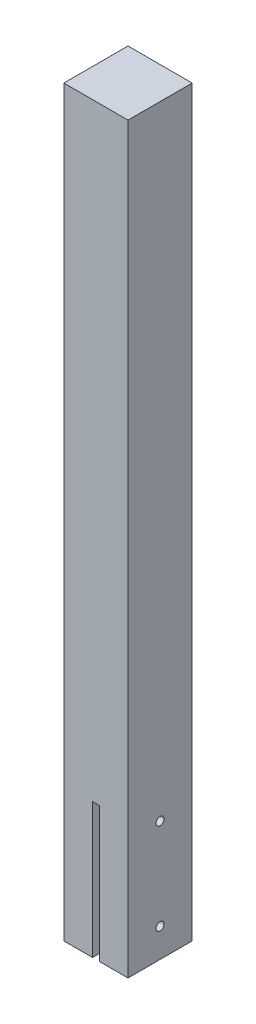
ISO-10303-21;
HEADER;
FILE_DESCRIPTION(('STEP AP214'),'2;1');
FILE_NAME('part.step','',(''),(''),'','','');
FILE_SCHEMA(('AUTOMOTIVE_DESIGN { 1 0 10303 214 1 1 1 1 }'));
ENDSEC;
DATA;
#1=APPLICATION_CONTEXT('core data for automotive mechanical design processes');
#2=APPLICATION_PROTOCOL_DEFINITION('international standard','automotive_design',2000,#1);
#3=PRODUCT_CONTEXT('',#1,'mechanical');
#4=PRODUCT('Part','Part','',(#3));
#5=PRODUCT_RELATED_PRODUCT_CATEGORY('part','',(#4));
#6=PRODUCT_DEFINITION_FORMATION('','',#4);
#7=PRODUCT_DEFINITION_CONTEXT('part definition',#1,'design');
#8=PRODUCT_DEFINITION('design','',#6,#7);
#9=PRODUCT_DEFINITION_SHAPE('','',#8);
#10=(LENGTH_UNIT() NAMED_UNIT(*) SI_UNIT(.MILLI.,.METRE.));
#11=(NAMED_UNIT(*) PLANE_ANGLE_UNIT() SI_UNIT($,.RADIAN.));
#12=(NAMED_UNIT(*) SI_UNIT($,.STERADIAN.) SOLID_ANGLE_UNIT());
#13=UNCERTAINTY_MEASURE_WITH_UNIT(LENGTH_MEASURE(1.E-05),#10,'distance_accuracy_value','');
#14=(GEOMETRIC_REPRESENTATION_CONTEXT(3) GLOBAL_UNCERTAINTY_ASSIGNED_CONTEXT((#13)) GLOBAL_UNIT_ASSIGNED_CONTEXT((#10,
#11,#12)) REPRESENTATION_CONTEXT('',''));
#15=CARTESIAN_POINT('',(0.,0.,0.));
#16=DIRECTION('',(0.,0.,1.));
#17=DIRECTION('',(1.,0.,0.));
#18=AXIS2_PLACEMENT_3D('',#15,#16,#17);
#19=CARTESIAN_POINT('',(-47.5,1100.,-47.5));
#20=DIRECTION('',(1.,0.,0.));
#21=DIRECTION('',(0.,0.,-1.));
#22=AXIS2_PLACEMENT_3D('',#19,#20,#21);
#23=PLANE('',#22);
#24=CARTESIAN_POINT('',(-47.5,177.5,0.));
#25=DIRECTION('',(1.,0.,0.));
#26=DIRECTION('',(0.,0.,-1.));
#27=AXIS2_PLACEMENT_3D('',#24,#25,#26);
#28=CIRCLE('',#27,5.99999999999999);
#29=CARTESIAN_POINT('',(-47.5,177.5,-5.99999999999999));
#30=VERTEX_POINT('',#29);
#31=EDGE_CURVE('E174',#30,#30,#28,.T.);
#32=ORIENTED_EDGE('',*,*,#31,.T.);
#33=EDGE_LOOP('',(#32));
#34=FACE_BOUND('',#33,.T.);
#35=DIRECTION('',(0.,0.,1.));
#36=VECTOR('',#35,1.);
#37=CARTESIAN_POINT('',(-47.5,0.,-47.5));
#38=LINE('',#37,#36);
#39=CARTESIAN_POINT('',(-47.5,0.,-47.5));
#40=VERTEX_POINT('',#39);
#41=CARTESIAN_POINT('',(-47.5000000000001,0.,47.5));
#42=VERTEX_POINT('',#41);
#43=EDGE_CURVE('E118',#40,#42,#38,.T.);
#44=ORIENTED_EDGE('',*,*,#43,.T.);
#45=DIRECTION('',(0.,-1.,0.));
#46=VECTOR('',#45,1.);
#47=CARTESIAN_POINT('',(-47.5000000000001,1100.,47.5));
#48=LINE('',#47,#46);
#49=CARTESIAN_POINT('',(-47.5000000000001,1100.,47.5));
#50=VERTEX_POINT('',#49);
#51=EDGE_CURVE('E140',#50,#42,#48,.T.);
#52=ORIENTED_EDGE('',*,*,#51,.F.);
#53=DIRECTION('',(0.,0.,1.));
#54=VECTOR('',#53,1.);
#55=CARTESIAN_POINT('',(-47.5,1100.,-47.5));
#56=LINE('',#55,#54);
#57=CARTESIAN_POINT('',(-47.5,1100.,-47.5));
#58=VERTEX_POINT('',#57);
#59=EDGE_CURVE('E134',#58,#50,#56,.T.);
#60=ORIENTED_EDGE('',*,*,#59,.F.);
#61=DIRECTION('',(0.,-1.,0.));
#62=VECTOR('',#61,1.);
#63=CARTESIAN_POINT('',(-47.5,1100.,-47.5));
#64=LINE('',#63,#62);
#65=EDGE_CURVE('E34',#58,#40,#64,.T.);
#66=ORIENTED_EDGE('',*,*,#65,.T.);
#67=EDGE_LOOP('',(#44,#52,#60,#66));
#68=FACE_BOUND('',#67,.T.);
#69=CARTESIAN_POINT('',(-47.5,42.5,0.));
#70=DIRECTION('',(1.,0.,0.));
#71=DIRECTION('',(0.,0.,-1.));
#72=AXIS2_PLACEMENT_3D('',#69,#70,#71);
#73=CIRCLE('',#72,5.99999999999999);
#74=CARTESIAN_POINT('',(-47.5,42.5,-5.99999999999999));
#75=VERTEX_POINT('',#74);
#76=EDGE_CURVE('E186',#75,#75,#73,.T.);
#77=ORIENTED_EDGE('',*,*,#76,.T.);
#78=EDGE_LOOP('',(#77));
#79=FACE_BOUND('',#78,.T.);
#80=ADVANCED_FACE('F26',(#34,#68,#79),#23,.F.);
#81=CARTESIAN_POINT('',(-5.,200.,-47.5));
#82=DIRECTION('',(-1.,0.,0.));
#83=DIRECTION('',(0.,0.,1.));
#84=AXIS2_PLACEMENT_3D('',#81,#82,#83);
#85=PLANE('',#84);
#86=CARTESIAN_POINT('',(-5.,177.5,0.));
#87=DIRECTION('',(-1.,0.,0.));
#88=DIRECTION('',(0.,0.,1.));
#89=AXIS2_PLACEMENT_3D('',#86,#87,#88);
#90=CIRCLE('',#89,5.99999999999999);
#91=CARTESIAN_POINT('',(-5.,177.5,5.99999999999999));
#92=VERTEX_POINT('',#91);
#93=EDGE_CURVE('E177',#92,#92,#90,.T.);
#94=ORIENTED_EDGE('',*,*,#93,.T.);
#95=EDGE_LOOP('',(#94));
#96=FACE_BOUND('',#95,.T.);
#97=DIRECTION('',(0.,0.,-1.));
#98=VECTOR('',#97,1.);
#99=CARTESIAN_POINT('',(-5.,0.,-47.5));
#100=LINE('',#99,#98);
#101=CARTESIAN_POINT('',(-5.,0.,47.5));
#102=VERTEX_POINT('',#101);
#103=CARTESIAN_POINT('',(-5.,0.,-47.5));
#104=VERTEX_POINT('',#103);
#105=EDGE_CURVE('E91',#102,#104,#100,.T.);
#106=ORIENTED_EDGE('',*,*,#105,.T.);
#107=DIRECTION('',(0.,-1.,0.));
#108=VECTOR('',#107,1.);
#109=CARTESIAN_POINT('',(-5.,200.,-47.5));
#110=LINE('',#109,#108);
#111=CARTESIAN_POINT('',(-5.,200.,-47.5));
#112=VERTEX_POINT('',#111);
#113=EDGE_CURVE('E95',#112,#104,#110,.T.);
#114=ORIENTED_EDGE('',*,*,#113,.F.);
#115=DIRECTION('',(0.,0.,-1.));
#116=VECTOR('',#115,1.);
#117=CARTESIAN_POINT('',(-5.,200.,-47.5));
#118=LINE('',#117,#116);
#119=CARTESIAN_POINT('',(-5.,200.,47.5));
#120=VERTEX_POINT('',#119);
#121=EDGE_CURVE('E166',#120,#112,#118,.T.);
#122=ORIENTED_EDGE('',*,*,#121,.F.);
#123=DIRECTION('',(0.,-1.,0.));
#124=VECTOR('',#123,1.);
#125=CARTESIAN_POINT('',(-5.,200.,47.5));
#126=LINE('',#125,#124);
#127=EDGE_CURVE('E98',#120,#102,#126,.T.);
#128=ORIENTED_EDGE('',*,*,#127,.T.);
#129=EDGE_LOOP('',(#106,#114,#122,#128));
#130=FACE_BOUND('',#129,.T.);
#131=CARTESIAN_POINT('',(-5.,42.5,0.));
#132=DIRECTION('',(-1.,0.,0.));
#133=DIRECTION('',(0.,0.,1.));
#134=AXIS2_PLACEMENT_3D('',#131,#132,#133);
#135=CIRCLE('',#134,5.99999999999999);
#136=CARTESIAN_POINT('',(-5.,42.5,5.99999999999999));
#137=VERTEX_POINT('',#136);
#138=EDGE_CURVE('E189',#137,#137,#135,.T.);
#139=ORIENTED_EDGE('',*,*,#138,.T.);
#140=EDGE_LOOP('',(#139));
#141=FACE_BOUND('',#140,.T.);
#142=ADVANCED_FACE('F93',(#96,#130,#141),#85,.F.);
#143=CARTESIAN_POINT('',(47.5,0.,47.5));
#144=DIRECTION('',(0.,-1.,0.));
#145=DIRECTION('',(0.,0.,-1.));
#146=AXIS2_PLACEMENT_3D('',#143,#144,#145);
#147=PLANE('',#146);
#148=ORIENTED_EDGE('',*,*,#105,.F.);
#149=DIRECTION('',(1.,0.,0.));
#150=VECTOR('',#149,1.);
#151=CARTESIAN_POINT('',(47.5,0.,47.5));
#152=LINE('',#151,#150);
#153=EDGE_CURVE('E128',#42,#102,#152,.T.);
#154=ORIENTED_EDGE('',*,*,#153,.F.);
#155=ORIENTED_EDGE('',*,*,#43,.F.);
#156=DIRECTION('',(-1.,0.,0.));
#157=VECTOR('',#156,1.);
#158=CARTESIAN_POINT('',(47.5,0.,-47.5));
#159=LINE('',#158,#157);
#160=EDGE_CURVE('E110',#104,#40,#159,.T.);
#161=ORIENTED_EDGE('',*,*,#160,.F.);
#162=EDGE_LOOP('',(#148,#154,#155,#161));
#163=FACE_BOUND('',#162,.T.);
#164=ADVANCED_FACE('F117',(#163),#147,.T.);
#165=CARTESIAN_POINT('',(47.5,1100.,-47.5));
#166=DIRECTION('',(-1.,0.,0.));
#167=DIRECTION('',(0.,0.,1.));
#168=AXIS2_PLACEMENT_3D('',#165,#166,#167);
#169=PLANE('',#168);
#170=CARTESIAN_POINT('',(47.5,42.5,0.));
#171=DIRECTION('',(-1.,0.,0.));
#172=DIRECTION('',(0.,0.,1.));
#173=AXIS2_PLACEMENT_3D('',#170,#171,#172);
#174=CIRCLE('',#173,5.99999999999999);
#175=CARTESIAN_POINT('',(47.5,42.5,5.99999999999999));
#176=VERTEX_POINT('',#175);
#177=EDGE_CURVE('E180',#176,#176,#174,.F.);
#178=ORIENTED_EDGE('',*,*,#177,.F.);
#179=EDGE_LOOP('',(#178));
#180=FACE_BOUND('',#179,.T.);
#181=CARTESIAN_POINT('',(47.5,177.5,0.));
#182=DIRECTION('',(-1.,0.,0.));
#183=DIRECTION('',(0.,0.,1.));
#184=AXIS2_PLACEMENT_3D('',#181,#182,#183);
#185=CIRCLE('',#184,5.99999999999999);
#186=CARTESIAN_POINT('',(47.5,177.5,5.99999999999999));
#187=VERTEX_POINT('',#186);
#188=EDGE_CURVE('E104',#187,#187,#185,.F.);
#189=ORIENTED_EDGE('',*,*,#188,.F.);
#190=EDGE_LOOP('',(#189));
#191=FACE_BOUND('',#190,.T.);
#192=DIRECTION('',(0.,0.,-1.));
#193=VECTOR('',#192,1.);
#194=CARTESIAN_POINT('',(47.5,0.,-47.5));
#195=LINE('',#194,#193);
#196=CARTESIAN_POINT('',(47.5,0.,47.5));
#197=VERTEX_POINT('',#196);
#198=CARTESIAN_POINT('',(47.5,0.,-47.5));
#199=VERTEX_POINT('',#198);
#200=EDGE_CURVE('E120',#197,#199,#195,.T.);
#201=ORIENTED_EDGE('',*,*,#200,.T.);
#202=DIRECTION('',(0.,-1.,0.));
#203=VECTOR('',#202,1.);
#204=CARTESIAN_POINT('',(47.5,1100.,-47.5));
#205=LINE('',#204,#203);
#206=CARTESIAN_POINT('',(47.5,1100.,-47.5));
#207=VERTEX_POINT('',#206);
#208=EDGE_CURVE('E11',#207,#199,#205,.T.);
#209=ORIENTED_EDGE('',*,*,#208,.F.);
#210=DIRECTION('',(0.,0.,-1.));
#211=VECTOR('',#210,1.);
#212=CARTESIAN_POINT('',(47.5,1100.,-47.5));
#213=LINE('',#212,#211);
#214=CARTESIAN_POINT('',(47.5,1100.,47.5));
#215=VERTEX_POINT('',#214);
#216=EDGE_CURVE('E130',#215,#207,#213,.T.);
#217=ORIENTED_EDGE('',*,*,#216,.F.);
#218=DIRECTION('',(0.,-1.,0.));
#219=VECTOR('',#218,1.);
#220=CARTESIAN_POINT('',(47.5,1100.,47.5));
#221=LINE('',#220,#219);
#222=EDGE_CURVE('E137',#215,#197,#221,.T.);
#223=ORIENTED_EDGE('',*,*,#222,.T.);
#224=EDGE_LOOP('',(#201,#209,#217,#223));
#225=FACE_BOUND('',#224,.T.);
#226=ADVANCED_FACE('F28',(#180,#191,#225),#169,.F.);
#227=CARTESIAN_POINT('',(47.5,1100.,-47.5));
#228=DIRECTION('',(0.,0.,1.));
#229=DIRECTION('',(1.,0.,0.));
#230=AXIS2_PLACEMENT_3D('',#227,#228,#229);
#231=PLANE('',#230);
#232=DIRECTION('',(1.,0.,0.));
#233=VECTOR('',#232,1.);
#234=CARTESIAN_POINT('',(-5.,200.,-47.5));
#235=LINE('',#234,#233);
#236=CARTESIAN_POINT('',(5.,200.,-47.5));
#237=VERTEX_POINT('',#236);
#238=EDGE_CURVE('E113',#112,#237,#235,.T.);
#239=ORIENTED_EDGE('',*,*,#238,.F.);
#240=ORIENTED_EDGE('',*,*,#113,.T.);
#241=ORIENTED_EDGE('',*,*,#160,.T.);
#242=ORIENTED_EDGE('',*,*,#65,.F.);
#243=DIRECTION('',(-1.,0.,0.));
#244=VECTOR('',#243,1.);
#245=CARTESIAN_POINT('',(47.5,1100.,-47.5));
#246=LINE('',#245,#244);
#247=EDGE_CURVE('E132',#207,#58,#246,.T.);
#248=ORIENTED_EDGE('',*,*,#247,.F.);
#249=ORIENTED_EDGE('',*,*,#208,.T.);
#250=CARTESIAN_POINT('',(5.,0.,-47.5));
#251=VERTEX_POINT('',#250);
#252=EDGE_CURVE('E119',#199,#251,#159,.T.);
#253=ORIENTED_EDGE('',*,*,#252,.T.);
#254=DIRECTION('',(0.,-1.,0.));
#255=VECTOR('',#254,1.);
#256=CARTESIAN_POINT('',(5.,200.,-47.5));
#257=LINE('',#256,#255);
#258=EDGE_CURVE('E41',#237,#251,#257,.T.);
#259=ORIENTED_EDGE('',*,*,#258,.F.);
#260=EDGE_LOOP('',(#239,#240,#241,#242,#248,#249,#253,#259));
#261=FACE_BOUND('',#260,.T.);
#262=ADVANCED_FACE('F108',(#261),#231,.F.);
#263=CARTESIAN_POINT('',(47.5,1100.,47.5));
#264=DIRECTION('',(0.,0.,-1.));
#265=DIRECTION('',(-1.,0.,0.));
#266=AXIS2_PLACEMENT_3D('',#263,#264,#265);
#267=PLANE('',#266);
#268=ORIENTED_EDGE('',*,*,#153,.T.);
#269=ORIENTED_EDGE('',*,*,#127,.F.);
#270=DIRECTION('',(-1.,0.,0.));
#271=VECTOR('',#270,1.);
#272=CARTESIAN_POINT('',(-5.,200.,47.5));
#273=LINE('',#272,#271);
#274=CARTESIAN_POINT('',(5.,200.,47.5));
#275=VERTEX_POINT('',#274);
#276=EDGE_CURVE('E114',#275,#120,#273,.T.);
#277=ORIENTED_EDGE('',*,*,#276,.F.);
#278=DIRECTION('',(0.,-1.,0.));
#279=VECTOR('',#278,1.);
#280=CARTESIAN_POINT('',(5.,200.,47.5));
#281=LINE('',#280,#279);
#282=CARTESIAN_POINT('',(5.,0.,47.5));
#283=VERTEX_POINT('',#282);
#284=EDGE_CURVE('E154',#275,#283,#281,.T.);
#285=ORIENTED_EDGE('',*,*,#284,.T.);
#286=EDGE_CURVE('E127',#283,#197,#152,.T.);
#287=ORIENTED_EDGE('',*,*,#286,.T.);
#288=ORIENTED_EDGE('',*,*,#222,.F.);
#289=DIRECTION('',(1.,0.,0.));
#290=VECTOR('',#289,1.);
#291=CARTESIAN_POINT('',(47.5,1100.,47.5));
#292=LINE('',#291,#290);
#293=EDGE_CURVE('E49',#50,#215,#292,.T.);
#294=ORIENTED_EDGE('',*,*,#293,.F.);
#295=ORIENTED_EDGE('',*,*,#51,.T.);
#296=EDGE_LOOP('',(#268,#269,#277,#285,#287,#288,#294,#295));
#297=FACE_BOUND('',#296,.T.);
#298=ADVANCED_FACE('F209',(#297),#267,.F.);
#299=CARTESIAN_POINT('',(47.5,1100.,47.5));
#300=DIRECTION('',(0.,-1.,0.));
#301=DIRECTION('',(0.,0.,-1.));
#302=AXIS2_PLACEMENT_3D('',#299,#300,#301);
#303=PLANE('',#302);
#304=ORIENTED_EDGE('',*,*,#216,.T.);
#305=ORIENTED_EDGE('',*,*,#247,.T.);
#306=ORIENTED_EDGE('',*,*,#59,.T.);
#307=ORIENTED_EDGE('',*,*,#293,.T.);
#308=EDGE_LOOP('',(#304,#305,#306,#307));
#309=FACE_BOUND('',#308,.T.);
#310=ADVANCED_FACE('F148',(#309),#303,.F.);
#311=DIRECTION('',(0.,0.,1.));
#312=VECTOR('',#311,1.);
#313=CARTESIAN_POINT('',(5.,0.,-47.5));
#314=LINE('',#313,#312);
#315=EDGE_CURVE('E103',#251,#283,#314,.T.);
#316=ORIENTED_EDGE('',*,*,#315,.F.);
#317=ORIENTED_EDGE('',*,*,#252,.F.);
#318=ORIENTED_EDGE('',*,*,#200,.F.);
#319=ORIENTED_EDGE('',*,*,#286,.F.);
#320=EDGE_LOOP('',(#316,#317,#318,#319));
#321=FACE_BOUND('',#320,.T.);
#322=ADVANCED_FACE('F153',(#321),#147,.T.);
#323=CARTESIAN_POINT('',(5.,200.,-47.5));
#324=DIRECTION('',(1.,0.,0.));
#325=DIRECTION('',(0.,0.,-1.));
#326=AXIS2_PLACEMENT_3D('',#323,#324,#325);
#327=PLANE('',#326);
#328=CARTESIAN_POINT('',(5.,42.5,0.));
#329=DIRECTION('',(1.,0.,0.));
#330=DIRECTION('',(0.,0.,-1.));
#331=AXIS2_PLACEMENT_3D('',#328,#329,#330);
#332=CIRCLE('',#331,5.99999999999999);
#333=CARTESIAN_POINT('',(5.,42.5,-5.99999999999999));
#334=VERTEX_POINT('',#333);
#335=EDGE_CURVE('E183',#334,#334,#332,.F.);
#336=ORIENTED_EDGE('',*,*,#335,.F.);
#337=EDGE_LOOP('',(#336));
#338=FACE_BOUND('',#337,.T.);
#339=CARTESIAN_POINT('',(5.,177.5,0.));
#340=DIRECTION('',(1.,0.,0.));
#341=DIRECTION('',(0.,0.,-1.));
#342=AXIS2_PLACEMENT_3D('',#339,#340,#341);
#343=CIRCLE('',#342,5.99999999999999);
#344=CARTESIAN_POINT('',(5.,177.5,-5.99999999999999));
#345=VERTEX_POINT('',#344);
#346=EDGE_CURVE('E171',#345,#345,#343,.F.);
#347=ORIENTED_EDGE('',*,*,#346,.F.);
#348=EDGE_LOOP('',(#347));
#349=FACE_BOUND('',#348,.T.);
#350=ORIENTED_EDGE('',*,*,#315,.T.);
#351=ORIENTED_EDGE('',*,*,#284,.F.);
#352=DIRECTION('',(0.,0.,1.));
#353=VECTOR('',#352,1.);
#354=CARTESIAN_POINT('',(5.,200.,-47.5));
#355=LINE('',#354,#353);
#356=EDGE_CURVE('E162',#237,#275,#355,.T.);
#357=ORIENTED_EDGE('',*,*,#356,.F.);
#358=ORIENTED_EDGE('',*,*,#258,.T.);
#359=EDGE_LOOP('',(#350,#351,#357,#358));
#360=FACE_BOUND('',#359,.T.);
#361=ADVANCED_FACE('F238',(#338,#349,#360),#327,.F.);
#362=CARTESIAN_POINT('',(-5.,200.,47.5));
#363=DIRECTION('',(0.,1.,0.));
#364=DIRECTION('',(0.,0.,1.));
#365=AXIS2_PLACEMENT_3D('',#362,#363,#364);
#366=PLANE('',#365);
#367=ORIENTED_EDGE('',*,*,#121,.T.);
#368=ORIENTED_EDGE('',*,*,#238,.T.);
#369=ORIENTED_EDGE('',*,*,#356,.T.);
#370=ORIENTED_EDGE('',*,*,#276,.T.);
#371=EDGE_LOOP('',(#367,#368,#369,#370));
#372=FACE_BOUND('',#371,.T.);
#373=ADVANCED_FACE('F230',(#372),#366,.F.);
#374=CARTESIAN_POINT('',(47.501,177.5,0.));
#375=DIRECTION('',(-1.,0.,0.));
#376=DIRECTION('',(0.,0.,1.));
#377=AXIS2_PLACEMENT_3D('',#374,#375,#376);
#378=CYLINDRICAL_SURFACE('',#377,5.99999999999999);
#379=ORIENTED_EDGE('',*,*,#346,.T.);
#380=EDGE_LOOP('',(#379));
#381=FACE_BOUND('',#380,.T.);
#382=ORIENTED_EDGE('',*,*,#188,.T.);
#383=EDGE_LOOP('',(#382));
#384=FACE_BOUND('',#383,.T.);
#385=ADVANCED_FACE('F227',(#381,#384),#378,.F.);
#386=CARTESIAN_POINT('',(-47.5010000000001,177.5,0.));
#387=DIRECTION('',(1.,0.,0.));
#388=DIRECTION('',(0.,0.,-1.));
#389=AXIS2_PLACEMENT_3D('',#386,#387,#388);
#390=CYLINDRICAL_SURFACE('',#389,5.99999999999999);
#391=ORIENTED_EDGE('',*,*,#93,.F.);
#392=EDGE_LOOP('',(#391));
#393=FACE_BOUND('',#392,.T.);
#394=ORIENTED_EDGE('',*,*,#31,.F.);
#395=EDGE_LOOP('',(#394));
#396=FACE_BOUND('',#395,.T.);
#397=ADVANCED_FACE('F229',(#393,#396),#390,.F.);
#398=CARTESIAN_POINT('',(47.501,42.5,0.));
#399=DIRECTION('',(-1.,0.,0.));
#400=DIRECTION('',(0.,0.,1.));
#401=AXIS2_PLACEMENT_3D('',#398,#399,#400);
#402=CYLINDRICAL_SURFACE('',#401,5.99999999999999);
#403=ORIENTED_EDGE('',*,*,#335,.T.);
#404=EDGE_LOOP('',(#403));
#405=FACE_BOUND('',#404,.T.);
#406=ORIENTED_EDGE('',*,*,#177,.T.);
#407=EDGE_LOOP('',(#406));
#408=FACE_BOUND('',#407,.T.);
#409=ADVANCED_FACE('F196',(#405,#408),#402,.F.);
#410=CARTESIAN_POINT('',(-47.5010000000001,42.5,0.));
#411=DIRECTION('',(1.,0.,0.));
#412=DIRECTION('',(0.,0.,-1.));
#413=AXIS2_PLACEMENT_3D('',#410,#411,#412);
#414=CYLINDRICAL_SURFACE('',#413,5.99999999999999);
#415=ORIENTED_EDGE('',*,*,#138,.F.);
#416=EDGE_LOOP('',(#415));
#417=FACE_BOUND('',#416,.T.);
#418=ORIENTED_EDGE('',*,*,#76,.F.);
#419=EDGE_LOOP('',(#418));
#420=FACE_BOUND('',#419,.T.);
#421=ADVANCED_FACE('F193',(#417,#420),#414,.F.);
#422=CLOSED_SHELL('',(#80,#142,#164,#226,#262,#298,#310,#322,#361,#373,#385,#397,#409,#421));
#423=MANIFOLD_SOLID_BREP('B2',#422);
#424=ADVANCED_BREP_SHAPE_REPRESENTATION('',(#18,#423),#14);
#425=SHAPE_DEFINITION_REPRESENTATION(#9,#424);
ENDSEC;
END-ISO-10303-21;
